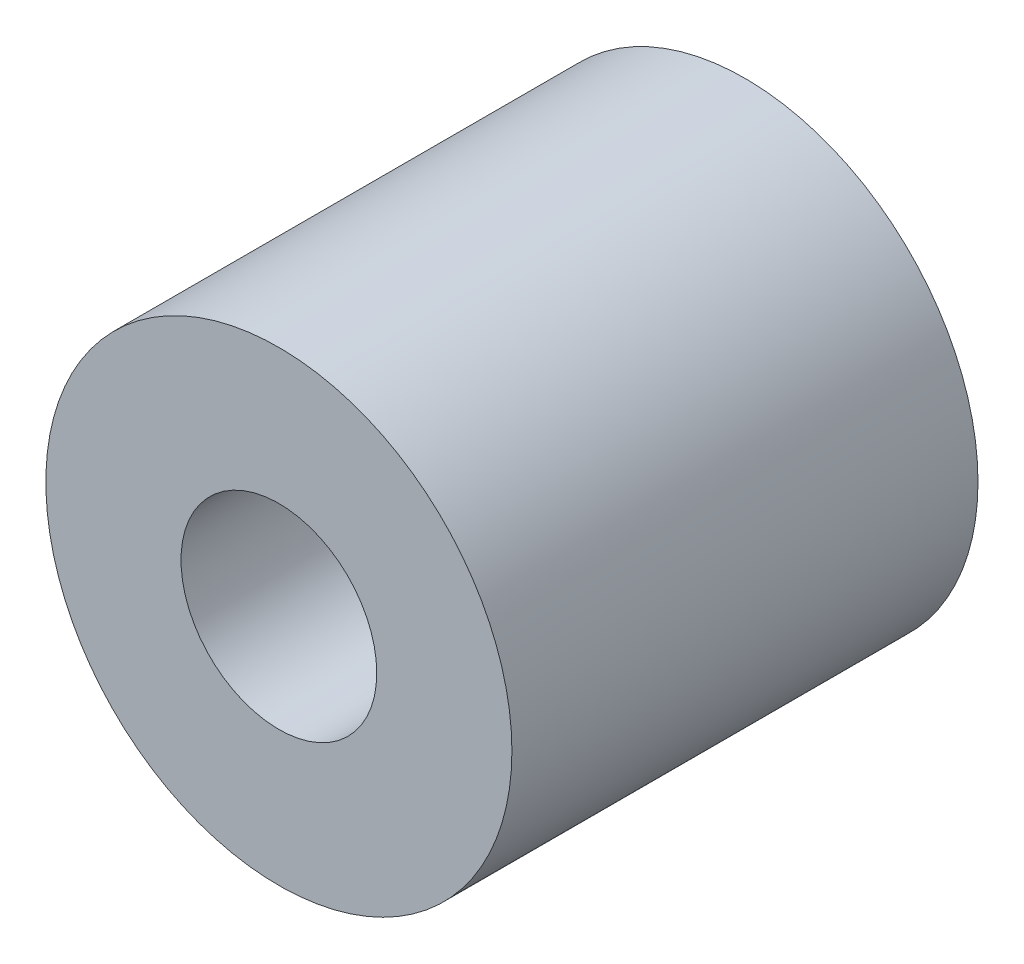
ISO-10303-21;
HEADER;
FILE_DESCRIPTION(('STEP AP214'),'2;1');
FILE_NAME('part.step','',(''),(''),'','','');
FILE_SCHEMA(('AUTOMOTIVE_DESIGN { 1 0 10303 214 1 1 1 1 }'));
ENDSEC;
DATA;
#1=APPLICATION_CONTEXT('core data for automotive mechanical design processes');
#2=APPLICATION_PROTOCOL_DEFINITION('international standard','automotive_design',2000,#1);
#3=PRODUCT_CONTEXT('',#1,'mechanical');
#4=PRODUCT('Part','Part','',(#3));
#5=PRODUCT_RELATED_PRODUCT_CATEGORY('part','',(#4));
#6=PRODUCT_DEFINITION_FORMATION('','',#4);
#7=PRODUCT_DEFINITION_CONTEXT('part definition',#1,'design');
#8=PRODUCT_DEFINITION('design','',#6,#7);
#9=PRODUCT_DEFINITION_SHAPE('','',#8);
#10=(LENGTH_UNIT() NAMED_UNIT(*) SI_UNIT(.MILLI.,.METRE.));
#11=(NAMED_UNIT(*) PLANE_ANGLE_UNIT() SI_UNIT($,.RADIAN.));
#12=(NAMED_UNIT(*) SI_UNIT($,.STERADIAN.) SOLID_ANGLE_UNIT());
#13=UNCERTAINTY_MEASURE_WITH_UNIT(LENGTH_MEASURE(1.E-05),#10,'distance_accuracy_value','');
#14=(GEOMETRIC_REPRESENTATION_CONTEXT(3) GLOBAL_UNCERTAINTY_ASSIGNED_CONTEXT((#13)) GLOBAL_UNIT_ASSIGNED_CONTEXT((#10,
#11,#12)) REPRESENTATION_CONTEXT('',''));
#15=CARTESIAN_POINT('',(0.,0.,0.));
#16=DIRECTION('',(0.,0.,1.));
#17=DIRECTION('',(1.,0.,0.));
#18=AXIS2_PLACEMENT_3D('',#15,#16,#17);
#19=CARTESIAN_POINT('',(0.,0.,10.));
#20=DIRECTION('',(0.,0.,1.));
#21=DIRECTION('',(1.,0.,0.));
#22=AXIS2_PLACEMENT_3D('',#19,#20,#21);
#23=PLANE('',#22);
#24=CARTESIAN_POINT('',(0.,0.,10.));
#25=DIRECTION('',(0.,0.,1.));
#26=DIRECTION('',(1.,0.,0.));
#27=AXIS2_PLACEMENT_3D('',#24,#25,#26);
#28=CIRCLE('',#27,5.);
#29=CARTESIAN_POINT('',(5.,0.,10.));
#30=VERTEX_POINT('',#29);
#31=EDGE_CURVE('E10',#30,#30,#28,.T.);
#32=ORIENTED_EDGE('',*,*,#31,.T.);
#33=EDGE_LOOP('',(#32));
#34=FACE_BOUND('',#33,.T.);
#35=CARTESIAN_POINT('',(0.,0.,10.));
#36=DIRECTION('',(0.,0.,1.));
#37=DIRECTION('',(1.,0.,0.));
#38=AXIS2_PLACEMENT_3D('',#35,#36,#37);
#39=CIRCLE('',#38,2.1);
#40=CARTESIAN_POINT('',(2.1,0.,10.));
#41=VERTEX_POINT('',#40);
#42=EDGE_CURVE('E42',#41,#41,#39,.T.);
#43=ORIENTED_EDGE('',*,*,#42,.F.);
#44=EDGE_LOOP('',(#43));
#45=FACE_BOUND('',#44,.T.);
#46=ADVANCED_FACE('F31',(#34,#45),#23,.T.);
#47=CARTESIAN_POINT('',(0.,0.,0.));
#48=DIRECTION('',(0.,0.,1.));
#49=DIRECTION('',(1.,0.,0.));
#50=AXIS2_PLACEMENT_3D('',#47,#48,#49);
#51=PLANE('',#50);
#52=CARTESIAN_POINT('',(0.,0.,0.));
#53=DIRECTION('',(0.,0.,1.));
#54=DIRECTION('',(1.,0.,0.));
#55=AXIS2_PLACEMENT_3D('',#52,#53,#54);
#56=CIRCLE('',#55,5.);
#57=CARTESIAN_POINT('',(5.,0.,0.));
#58=VERTEX_POINT('',#57);
#59=EDGE_CURVE('E35',#58,#58,#56,.T.);
#60=ORIENTED_EDGE('',*,*,#59,.F.);
#61=EDGE_LOOP('',(#60));
#62=FACE_BOUND('',#61,.T.);
#63=CARTESIAN_POINT('',(0.,0.,0.));
#64=DIRECTION('',(0.,0.,1.));
#65=DIRECTION('',(1.,0.,0.));
#66=AXIS2_PLACEMENT_3D('',#63,#64,#65);
#67=CIRCLE('',#66,2.1);
#68=CARTESIAN_POINT('',(2.1,0.,0.));
#69=VERTEX_POINT('',#68);
#70=EDGE_CURVE('E44',#69,#69,#67,.T.);
#71=ORIENTED_EDGE('',*,*,#70,.T.);
#72=EDGE_LOOP('',(#71));
#73=FACE_BOUND('',#72,.T.);
#74=ADVANCED_FACE('F54',(#62,#73),#51,.F.);
#75=CARTESIAN_POINT('',(0.,0.,10.));
#76=DIRECTION('',(0.,0.,-1.));
#77=DIRECTION('',(-1.,0.,0.));
#78=AXIS2_PLACEMENT_3D('',#75,#76,#77);
#79=CYLINDRICAL_SURFACE('',#78,5.);
#80=ORIENTED_EDGE('',*,*,#31,.F.);
#81=EDGE_LOOP('',(#80));
#82=FACE_BOUND('',#81,.T.);
#83=ORIENTED_EDGE('',*,*,#59,.T.);
#84=EDGE_LOOP('',(#83));
#85=FACE_BOUND('',#84,.T.);
#86=ADVANCED_FACE('F33',(#82,#85),#79,.T.);
#87=CARTESIAN_POINT('',(0.,0.,10.));
#88=DIRECTION('',(0.,0.,-1.));
#89=DIRECTION('',(-1.,0.,0.));
#90=AXIS2_PLACEMENT_3D('',#87,#88,#89);
#91=CYLINDRICAL_SURFACE('',#90,2.1);
#92=ORIENTED_EDGE('',*,*,#42,.T.);
#93=EDGE_LOOP('',(#92));
#94=FACE_BOUND('',#93,.T.);
#95=ORIENTED_EDGE('',*,*,#70,.F.);
#96=EDGE_LOOP('',(#95));
#97=FACE_BOUND('',#96,.T.);
#98=ADVANCED_FACE('F50',(#94,#97),#91,.F.);
#99=CLOSED_SHELL('',(#46,#74,#86,#98));
#100=MANIFOLD_SOLID_BREP('B2',#99);
#101=ADVANCED_BREP_SHAPE_REPRESENTATION('',(#18,#100),#14);
#102=SHAPE_DEFINITION_REPRESENTATION(#9,#101);
ENDSEC;
END-ISO-10303-21;
